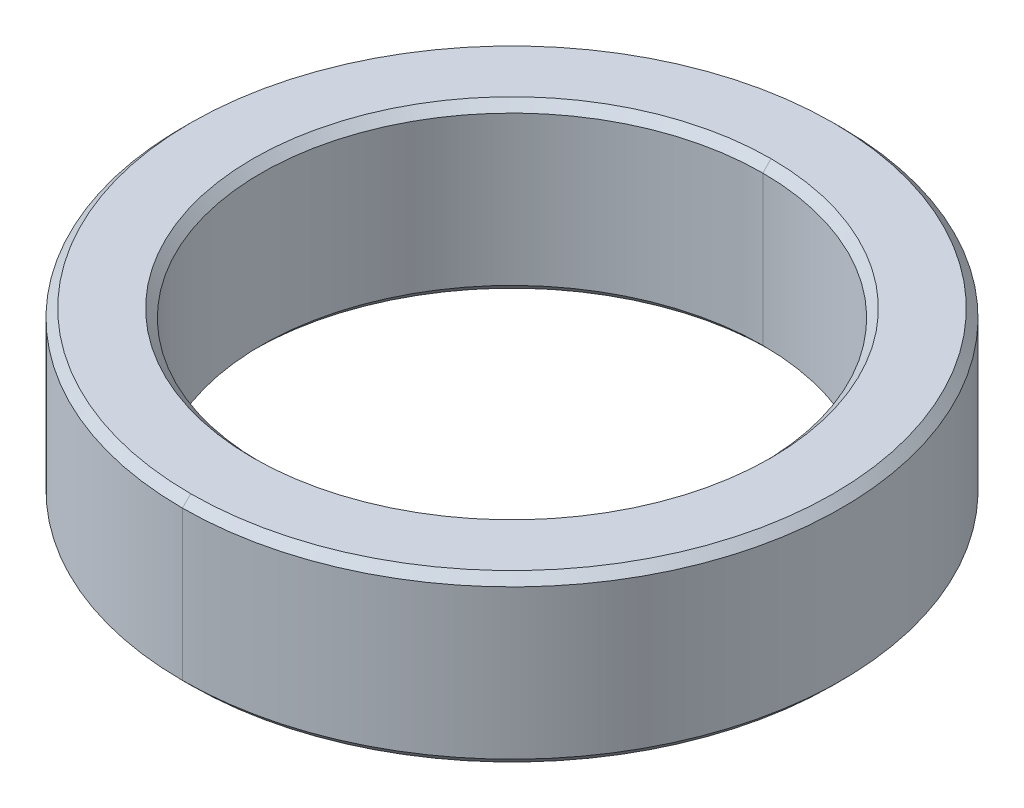
ISO-10303-21;
HEADER;
FILE_DESCRIPTION(('STEP AP214'),'2;1');
FILE_NAME('part.step','',(''),(''),'','','');
FILE_SCHEMA(('AUTOMOTIVE_DESIGN { 1 0 10303 214 1 1 1 1 }'));
ENDSEC;
DATA;
#1=APPLICATION_CONTEXT('core data for automotive mechanical design processes');
#2=APPLICATION_PROTOCOL_DEFINITION('international standard','automotive_design',2000,#1);
#3=PRODUCT_CONTEXT('',#1,'mechanical');
#4=PRODUCT('Part','Part','',(#3));
#5=PRODUCT_RELATED_PRODUCT_CATEGORY('part','',(#4));
#6=PRODUCT_DEFINITION_FORMATION('','',#4);
#7=PRODUCT_DEFINITION_CONTEXT('part definition',#1,'design');
#8=PRODUCT_DEFINITION('design','',#6,#7);
#9=PRODUCT_DEFINITION_SHAPE('','',#8);
#10=(LENGTH_UNIT() NAMED_UNIT(*) SI_UNIT(.MILLI.,.METRE.));
#11=(NAMED_UNIT(*) PLANE_ANGLE_UNIT() SI_UNIT($,.RADIAN.));
#12=(NAMED_UNIT(*) SI_UNIT($,.STERADIAN.) SOLID_ANGLE_UNIT());
#13=UNCERTAINTY_MEASURE_WITH_UNIT(LENGTH_MEASURE(1.E-05),#10,'distance_accuracy_value','');
#14=(GEOMETRIC_REPRESENTATION_CONTEXT(3) GLOBAL_UNCERTAINTY_ASSIGNED_CONTEXT((#13)) GLOBAL_UNIT_ASSIGNED_CONTEXT((#10,
#11,#12)) REPRESENTATION_CONTEXT('',''));
#15=CARTESIAN_POINT('',(0.,0.,0.));
#16=DIRECTION('',(0.,0.,1.));
#17=DIRECTION('',(1.,0.,0.));
#18=AXIS2_PLACEMENT_3D('',#15,#16,#17);
#19=CARTESIAN_POINT('',(0.,0.9,0.));
#20=DIRECTION('',(0.,1.,0.));
#21=DIRECTION('',(0.,0.,1.));
#22=AXIS2_PLACEMENT_3D('',#19,#20,#21);
#23=CONICAL_SURFACE('',#22,3.025,0.785398163397443);
#24=DIRECTION('',(0.,0.707106781186551,-0.707106781186545));
#25=VECTOR('',#24,1.);
#26=CARTESIAN_POINT('',(0.,0.9,-3.025));
#27=LINE('',#26,#25);
#28=CARTESIAN_POINT('',(0.,0.9,-3.025));
#29=VERTEX_POINT('',#28);
#30=CARTESIAN_POINT('',(0.,1.,-3.125));
#31=VERTEX_POINT('',#30);
#32=EDGE_CURVE('E111',#29,#31,#27,.T.);
#33=ORIENTED_EDGE('',*,*,#32,.F.);
#34=CARTESIAN_POINT('',(0.,0.9,0.));
#35=DIRECTION('',(0.,1.,0.));
#36=DIRECTION('',(0.,0.,1.));
#37=AXIS2_PLACEMENT_3D('',#34,#35,#36);
#38=CIRCLE('',#37,3.025);
#39=CARTESIAN_POINT('',(0.,0.9,3.025));
#40=VERTEX_POINT('',#39);
#41=EDGE_CURVE('E26',#40,#29,#38,.T.);
#42=ORIENTED_EDGE('',*,*,#41,.F.);
#43=DIRECTION('',(0.,0.707106781186551,0.707106781186545));
#44=VECTOR('',#43,1.);
#45=CARTESIAN_POINT('',(0.,0.9,3.025));
#46=LINE('',#45,#44);
#47=CARTESIAN_POINT('',(0.,1.,3.125));
#48=VERTEX_POINT('',#47);
#49=EDGE_CURVE('E19',#40,#48,#46,.T.);
#50=ORIENTED_EDGE('',*,*,#49,.T.);
#51=CARTESIAN_POINT('',(0.,1.,0.));
#52=DIRECTION('',(0.,-1.,0.));
#53=DIRECTION('',(0.,0.,1.));
#54=AXIS2_PLACEMENT_3D('',#51,#52,#53);
#55=CIRCLE('',#54,3.125);
#56=EDGE_CURVE('E108',#31,#48,#55,.T.);
#57=ORIENTED_EDGE('',*,*,#56,.F.);
#58=EDGE_LOOP('',(#33,#42,#50,#57));
#59=FACE_BOUND('',#58,.T.);
#60=ADVANCED_FACE('F15',(#59),#23,.F.);
#61=CARTESIAN_POINT('',(0.,-1.,0.));
#62=DIRECTION('',(0.,-1.,0.));
#63=DIRECTION('',(0.,0.,-1.));
#64=AXIS2_PLACEMENT_3D('',#61,#62,#63);
#65=CONICAL_SURFACE('',#64,3.125,0.785398163397446);
#66=DIRECTION('',(0.,-0.707106781186549,0.707106781186546));
#67=VECTOR('',#66,1.);
#68=CARTESIAN_POINT('',(0.,-1.,3.125));
#69=LINE('',#68,#67);
#70=CARTESIAN_POINT('',(0.,-0.9,3.025));
#71=VERTEX_POINT('',#70);
#72=CARTESIAN_POINT('',(0.,-1.,3.125));
#73=VERTEX_POINT('',#72);
#74=EDGE_CURVE('E155',#71,#73,#69,.T.);
#75=ORIENTED_EDGE('',*,*,#74,.F.);
#76=CARTESIAN_POINT('',(0.,-0.9,0.));
#77=DIRECTION('',(0.,-1.,0.));
#78=DIRECTION('',(0.,0.,1.));
#79=AXIS2_PLACEMENT_3D('',#76,#77,#78);
#80=CIRCLE('',#79,3.025);
#81=CARTESIAN_POINT('',(0.,-0.9,-3.025));
#82=VERTEX_POINT('',#81);
#83=EDGE_CURVE('E10',#82,#71,#80,.T.);
#84=ORIENTED_EDGE('',*,*,#83,.F.);
#85=DIRECTION('',(0.,-0.707106781186549,-0.707106781186546));
#86=VECTOR('',#85,1.);
#87=CARTESIAN_POINT('',(0.,-1.,-3.125));
#88=LINE('',#87,#86);
#89=CARTESIAN_POINT('',(0.,-1.,-3.125));
#90=VERTEX_POINT('',#89);
#91=EDGE_CURVE('E172',#82,#90,#88,.T.);
#92=ORIENTED_EDGE('',*,*,#91,.T.);
#93=CARTESIAN_POINT('',(0.,-1.,0.));
#94=DIRECTION('',(0.,1.,0.));
#95=DIRECTION('',(0.,0.,1.));
#96=AXIS2_PLACEMENT_3D('',#93,#94,#95);
#97=CIRCLE('',#96,3.125);
#98=EDGE_CURVE('E201',#73,#90,#97,.T.);
#99=ORIENTED_EDGE('',*,*,#98,.F.);
#100=EDGE_LOOP('',(#75,#84,#92,#99));
#101=FACE_BOUND('',#100,.T.);
#102=ADVANCED_FACE('F220',(#101),#65,.F.);
#103=CARTESIAN_POINT('',(0.,1.,0.));
#104=DIRECTION('',(0.,-1.,0.));
#105=DIRECTION('',(0.,0.,-1.));
#106=AXIS2_PLACEMENT_3D('',#103,#104,#105);
#107=CONICAL_SURFACE('',#106,3.875,0.785398163397457);
#108=DIRECTION('',(0.,-0.707106781186542,0.707106781186554));
#109=VECTOR('',#108,1.);
#110=CARTESIAN_POINT('',(0.,1.,3.875));
#111=LINE('',#110,#109);
#112=CARTESIAN_POINT('',(0.,1.,3.875));
#113=VERTEX_POINT('',#112);
#114=CARTESIAN_POINT('',(0.,0.9,3.975));
#115=VERTEX_POINT('',#114);
#116=EDGE_CURVE('E151',#113,#115,#111,.T.);
#117=ORIENTED_EDGE('',*,*,#116,.F.);
#118=CARTESIAN_POINT('',(0.,1.,0.));
#119=DIRECTION('',(0.,1.,0.));
#120=DIRECTION('',(0.,0.,1.));
#121=AXIS2_PLACEMENT_3D('',#118,#119,#120);
#122=CIRCLE('',#121,3.875);
#123=CARTESIAN_POINT('',(0.,1.,-3.875));
#124=VERTEX_POINT('',#123);
#125=EDGE_CURVE('E117',#124,#113,#122,.T.);
#126=ORIENTED_EDGE('',*,*,#125,.F.);
#127=DIRECTION('',(0.,-0.707106781186542,-0.707106781186554));
#128=VECTOR('',#127,1.);
#129=CARTESIAN_POINT('',(0.,1.,-3.875));
#130=LINE('',#129,#128);
#131=CARTESIAN_POINT('',(0.,0.9,-3.975));
#132=VERTEX_POINT('',#131);
#133=EDGE_CURVE('E140',#124,#132,#130,.T.);
#134=ORIENTED_EDGE('',*,*,#133,.T.);
#135=CARTESIAN_POINT('',(0.,0.9,0.));
#136=DIRECTION('',(0.,-1.,0.));
#137=DIRECTION('',(0.,0.,1.));
#138=AXIS2_PLACEMENT_3D('',#135,#136,#137);
#139=CIRCLE('',#138,3.975);
#140=EDGE_CURVE('E88',#115,#132,#139,.T.);
#141=ORIENTED_EDGE('',*,*,#140,.F.);
#142=EDGE_LOOP('',(#117,#126,#134,#141));
#143=FACE_BOUND('',#142,.T.);
#144=ADVANCED_FACE('F225',(#143),#107,.T.);
#145=CARTESIAN_POINT('',(0.,-0.9,0.));
#146=DIRECTION('',(0.,1.,0.));
#147=DIRECTION('',(0.,0.,1.));
#148=AXIS2_PLACEMENT_3D('',#145,#146,#147);
#149=CONICAL_SURFACE('',#148,3.975,0.785398163397448);
#150=DIRECTION('',(0.,0.707106781186548,-0.707106781186548));
#151=VECTOR('',#150,1.);
#152=CARTESIAN_POINT('',(0.,-0.9,-3.975));
#153=LINE('',#152,#151);
#154=CARTESIAN_POINT('',(0.,-1.,-3.875));
#155=VERTEX_POINT('',#154);
#156=CARTESIAN_POINT('',(0.,-0.9,-3.975));
#157=VERTEX_POINT('',#156);
#158=EDGE_CURVE('E139',#155,#157,#153,.T.);
#159=ORIENTED_EDGE('',*,*,#158,.F.);
#160=CARTESIAN_POINT('',(0.,-1.,0.));
#161=DIRECTION('',(0.,-1.,0.));
#162=DIRECTION('',(0.,0.,1.));
#163=AXIS2_PLACEMENT_3D('',#160,#161,#162);
#164=CIRCLE('',#163,3.875);
#165=CARTESIAN_POINT('',(0.,-1.,3.875));
#166=VERTEX_POINT('',#165);
#167=EDGE_CURVE('E99',#166,#155,#164,.T.);
#168=ORIENTED_EDGE('',*,*,#167,.F.);
#169=DIRECTION('',(0.,0.707106781186548,0.707106781186548));
#170=VECTOR('',#169,1.);
#171=CARTESIAN_POINT('',(0.,-0.9,3.975));
#172=LINE('',#171,#170);
#173=CARTESIAN_POINT('',(0.,-0.9,3.975));
#174=VERTEX_POINT('',#173);
#175=EDGE_CURVE('E141',#166,#174,#172,.T.);
#176=ORIENTED_EDGE('',*,*,#175,.T.);
#177=CARTESIAN_POINT('',(0.,-0.9,0.));
#178=DIRECTION('',(0.,1.,0.));
#179=DIRECTION('',(0.,0.,1.));
#180=AXIS2_PLACEMENT_3D('',#177,#178,#179);
#181=CIRCLE('',#180,3.975);
#182=EDGE_CURVE('E41',#157,#174,#181,.T.);
#183=ORIENTED_EDGE('',*,*,#182,.F.);
#184=EDGE_LOOP('',(#159,#168,#176,#183));
#185=FACE_BOUND('',#184,.T.);
#186=ADVANCED_FACE('F254',(#185),#149,.T.);
#187=CARTESIAN_POINT('',(0.,1.,0.));
#188=DIRECTION('',(0.,-1.,0.));
#189=DIRECTION('',(0.,0.,-1.));
#190=AXIS2_PLACEMENT_3D('',#187,#188,#189);
#191=CYLINDRICAL_SURFACE('',#190,3.025);
#192=DIRECTION('',(0.,-1.,0.));
#193=VECTOR('',#192,1.);
#194=CARTESIAN_POINT('',(0.,1.,3.025));
#195=LINE('',#194,#193);
#196=EDGE_CURVE('E145',#40,#71,#195,.T.);
#197=ORIENTED_EDGE('',*,*,#196,.F.);
#198=ORIENTED_EDGE('',*,*,#41,.T.);
#199=DIRECTION('',(0.,-1.,0.));
#200=VECTOR('',#199,1.);
#201=CARTESIAN_POINT('',(0.,1.,-3.025));
#202=LINE('',#201,#200);
#203=EDGE_CURVE('E165',#29,#82,#202,.T.);
#204=ORIENTED_EDGE('',*,*,#203,.T.);
#205=ORIENTED_EDGE('',*,*,#83,.T.);
#206=EDGE_LOOP('',(#197,#198,#204,#205));
#207=FACE_BOUND('',#206,.T.);
#208=ADVANCED_FACE('F242',(#207),#191,.F.);
#209=CARTESIAN_POINT('',(0.,1.,0.));
#210=DIRECTION('',(0.,-1.,0.));
#211=DIRECTION('',(0.,0.,-1.));
#212=AXIS2_PLACEMENT_3D('',#209,#210,#211);
#213=CYLINDRICAL_SURFACE('',#212,3.975);
#214=DIRECTION('',(0.,-1.,0.));
#215=VECTOR('',#214,1.);
#216=CARTESIAN_POINT('',(0.,1.,3.975));
#217=LINE('',#216,#215);
#218=EDGE_CURVE('E161',#115,#174,#217,.T.);
#219=ORIENTED_EDGE('',*,*,#218,.F.);
#220=ORIENTED_EDGE('',*,*,#140,.T.);
#221=DIRECTION('',(0.,-1.,0.));
#222=VECTOR('',#221,1.);
#223=CARTESIAN_POINT('',(0.,1.,-3.975));
#224=LINE('',#223,#222);
#225=EDGE_CURVE('E164',#132,#157,#224,.T.);
#226=ORIENTED_EDGE('',*,*,#225,.T.);
#227=ORIENTED_EDGE('',*,*,#182,.T.);
#228=EDGE_LOOP('',(#219,#220,#226,#227));
#229=FACE_BOUND('',#228,.T.);
#230=ADVANCED_FACE('F236',(#229),#213,.T.);
#231=CARTESIAN_POINT('',(0.,-1.,0.));
#232=DIRECTION('',(0.,1.,0.));
#233=DIRECTION('',(1.,0.,0.));
#234=AXIS2_PLACEMENT_3D('',#231,#232,#233);
#235=PLANE('',#234);
#236=CARTESIAN_POINT('',(0.,-1.,0.));
#237=DIRECTION('',(0.,1.,0.));
#238=DIRECTION('',(0.,0.,1.));
#239=AXIS2_PLACEMENT_3D('',#236,#237,#238);
#240=CIRCLE('',#239,3.125);
#241=EDGE_CURVE('E159',#90,#73,#240,.T.);
#242=ORIENTED_EDGE('',*,*,#241,.T.);
#243=ORIENTED_EDGE('',*,*,#98,.T.);
#244=EDGE_LOOP('',(#242,#243));
#245=FACE_BOUND('',#244,.T.);
#246=ORIENTED_EDGE('',*,*,#167,.T.);
#247=CARTESIAN_POINT('',(0.,-1.,0.));
#248=DIRECTION('',(0.,-1.,0.));
#249=DIRECTION('',(0.,0.,1.));
#250=AXIS2_PLACEMENT_3D('',#247,#248,#249);
#251=CIRCLE('',#250,3.875);
#252=EDGE_CURVE('E137',#155,#166,#251,.T.);
#253=ORIENTED_EDGE('',*,*,#252,.T.);
#254=EDGE_LOOP('',(#246,#253));
#255=FACE_BOUND('',#254,.T.);
#256=ADVANCED_FACE('F241',(#245,#255),#235,.F.);
#257=CARTESIAN_POINT('',(0.,1.,0.));
#258=DIRECTION('',(0.,1.,0.));
#259=DIRECTION('',(1.,0.,0.));
#260=AXIS2_PLACEMENT_3D('',#257,#258,#259);
#261=PLANE('',#260);
#262=CARTESIAN_POINT('',(0.,1.,0.));
#263=DIRECTION('',(0.,-1.,0.));
#264=DIRECTION('',(0.,0.,1.));
#265=AXIS2_PLACEMENT_3D('',#262,#263,#264);
#266=CIRCLE('',#265,3.125);
#267=EDGE_CURVE('E119',#48,#31,#266,.T.);
#268=ORIENTED_EDGE('',*,*,#267,.T.);
#269=ORIENTED_EDGE('',*,*,#56,.T.);
#270=EDGE_LOOP('',(#268,#269));
#271=FACE_BOUND('',#270,.T.);
#272=ORIENTED_EDGE('',*,*,#125,.T.);
#273=CARTESIAN_POINT('',(0.,1.,0.));
#274=DIRECTION('',(0.,1.,0.));
#275=DIRECTION('',(0.,0.,1.));
#276=AXIS2_PLACEMENT_3D('',#273,#274,#275);
#277=CIRCLE('',#276,3.875);
#278=EDGE_CURVE('E176',#113,#124,#277,.T.);
#279=ORIENTED_EDGE('',*,*,#278,.T.);
#280=EDGE_LOOP('',(#272,#279));
#281=FACE_BOUND('',#280,.T.);
#282=ADVANCED_FACE('F120',(#271,#281),#261,.T.);
#283=CARTESIAN_POINT('',(0.,1.,0.));
#284=DIRECTION('',(0.,-1.,0.));
#285=DIRECTION('',(0.,0.,-1.));
#286=AXIS2_PLACEMENT_3D('',#283,#284,#285);
#287=CYLINDRICAL_SURFACE('',#286,3.975);
#288=CARTESIAN_POINT('',(0.,0.9,0.));
#289=DIRECTION('',(0.,-1.,0.));
#290=DIRECTION('',(0.,0.,1.));
#291=AXIS2_PLACEMENT_3D('',#288,#289,#290);
#292=CIRCLE('',#291,3.975);
#293=EDGE_CURVE('E147',#132,#115,#292,.T.);
#294=ORIENTED_EDGE('',*,*,#293,.T.);
#295=ORIENTED_EDGE('',*,*,#218,.T.);
#296=CARTESIAN_POINT('',(0.,-0.9,0.));
#297=DIRECTION('',(0.,1.,0.));
#298=DIRECTION('',(0.,0.,1.));
#299=AXIS2_PLACEMENT_3D('',#296,#297,#298);
#300=CIRCLE('',#299,3.975);
#301=EDGE_CURVE('E146',#174,#157,#300,.T.);
#302=ORIENTED_EDGE('',*,*,#301,.T.);
#303=ORIENTED_EDGE('',*,*,#225,.F.);
#304=EDGE_LOOP('',(#294,#295,#302,#303));
#305=FACE_BOUND('',#304,.T.);
#306=ADVANCED_FACE('F278',(#305),#287,.T.);
#307=CARTESIAN_POINT('',(0.,1.,0.));
#308=DIRECTION('',(0.,-1.,0.));
#309=DIRECTION('',(0.,0.,-1.));
#310=AXIS2_PLACEMENT_3D('',#307,#308,#309);
#311=CYLINDRICAL_SURFACE('',#310,3.025);
#312=CARTESIAN_POINT('',(0.,0.9,0.));
#313=DIRECTION('',(0.,1.,0.));
#314=DIRECTION('',(0.,0.,1.));
#315=AXIS2_PLACEMENT_3D('',#312,#313,#314);
#316=CIRCLE('',#315,3.025);
#317=EDGE_CURVE('E127',#29,#40,#316,.T.);
#318=ORIENTED_EDGE('',*,*,#317,.T.);
#319=ORIENTED_EDGE('',*,*,#196,.T.);
#320=CARTESIAN_POINT('',(0.,-0.9,0.));
#321=DIRECTION('',(0.,-1.,0.));
#322=DIRECTION('',(0.,0.,1.));
#323=AXIS2_PLACEMENT_3D('',#320,#321,#322);
#324=CIRCLE('',#323,3.025);
#325=EDGE_CURVE('E160',#71,#82,#324,.T.);
#326=ORIENTED_EDGE('',*,*,#325,.T.);
#327=ORIENTED_EDGE('',*,*,#203,.F.);
#328=EDGE_LOOP('',(#318,#319,#326,#327));
#329=FACE_BOUND('',#328,.T.);
#330=ADVANCED_FACE('F17',(#329),#311,.F.);
#331=CARTESIAN_POINT('',(0.,-0.9,0.));
#332=DIRECTION('',(0.,1.,0.));
#333=DIRECTION('',(0.,0.,1.));
#334=AXIS2_PLACEMENT_3D('',#331,#332,#333);
#335=CONICAL_SURFACE('',#334,3.975,0.785398163397448);
#336=ORIENTED_EDGE('',*,*,#252,.F.);
#337=ORIENTED_EDGE('',*,*,#158,.T.);
#338=ORIENTED_EDGE('',*,*,#301,.F.);
#339=ORIENTED_EDGE('',*,*,#175,.F.);
#340=EDGE_LOOP('',(#336,#337,#338,#339));
#341=FACE_BOUND('',#340,.T.);
#342=ADVANCED_FACE('F295',(#341),#335,.T.);
#343=CARTESIAN_POINT('',(0.,1.,0.));
#344=DIRECTION('',(0.,-1.,0.));
#345=DIRECTION('',(0.,0.,-1.));
#346=AXIS2_PLACEMENT_3D('',#343,#344,#345);
#347=CONICAL_SURFACE('',#346,3.875,0.785398163397457);
#348=ORIENTED_EDGE('',*,*,#278,.F.);
#349=ORIENTED_EDGE('',*,*,#116,.T.);
#350=ORIENTED_EDGE('',*,*,#293,.F.);
#351=ORIENTED_EDGE('',*,*,#133,.F.);
#352=EDGE_LOOP('',(#348,#349,#350,#351));
#353=FACE_BOUND('',#352,.T.);
#354=ADVANCED_FACE('F268',(#353),#347,.T.);
#355=CARTESIAN_POINT('',(0.,-1.,0.));
#356=DIRECTION('',(0.,-1.,0.));
#357=DIRECTION('',(0.,0.,-1.));
#358=AXIS2_PLACEMENT_3D('',#355,#356,#357);
#359=CONICAL_SURFACE('',#358,3.125,0.785398163397446);
#360=ORIENTED_EDGE('',*,*,#325,.F.);
#361=ORIENTED_EDGE('',*,*,#74,.T.);
#362=ORIENTED_EDGE('',*,*,#241,.F.);
#363=ORIENTED_EDGE('',*,*,#91,.F.);
#364=EDGE_LOOP('',(#360,#361,#362,#363));
#365=FACE_BOUND('',#364,.T.);
#366=ADVANCED_FACE('F263',(#365),#359,.F.);
#367=CARTESIAN_POINT('',(0.,0.9,0.));
#368=DIRECTION('',(0.,1.,0.));
#369=DIRECTION('',(0.,0.,1.));
#370=AXIS2_PLACEMENT_3D('',#367,#368,#369);
#371=CONICAL_SURFACE('',#370,3.025,0.785398163397443);
#372=ORIENTED_EDGE('',*,*,#317,.F.);
#373=ORIENTED_EDGE('',*,*,#32,.T.);
#374=ORIENTED_EDGE('',*,*,#267,.F.);
#375=ORIENTED_EDGE('',*,*,#49,.F.);
#376=EDGE_LOOP('',(#372,#373,#374,#375));
#377=FACE_BOUND('',#376,.T.);
#378=ADVANCED_FACE('F125',(#377),#371,.F.);
#379=CLOSED_SHELL('',(#60,#102,#144,#186,#208,#230,#256,#282,#306,#330,#342,#354,#366,#378));
#380=MANIFOLD_SOLID_BREP('B1',#379);
#381=ADVANCED_BREP_SHAPE_REPRESENTATION('',(#18,#380),#14);
#382=SHAPE_DEFINITION_REPRESENTATION(#9,#381);
ENDSEC;
END-ISO-10303-21;
